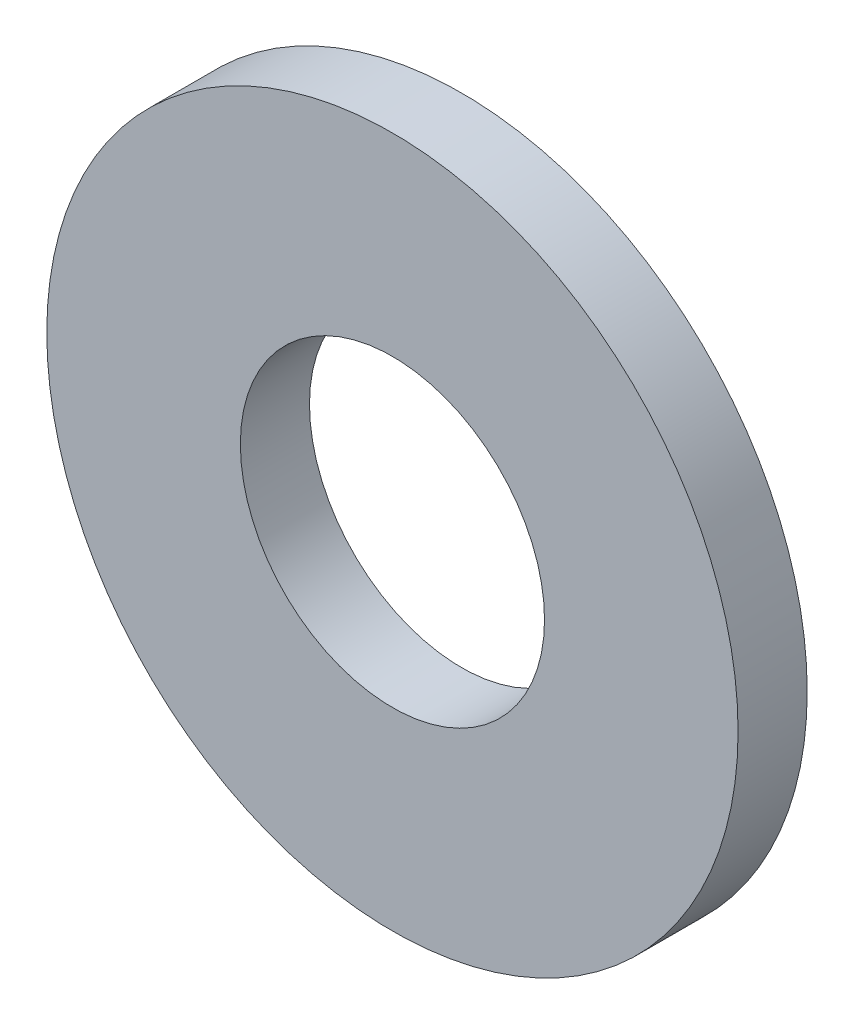
ISO-10303-21;
HEADER;
FILE_DESCRIPTION(('STEP AP214'),'2;1');
FILE_NAME('part.step','',(''),(''),'','','');
FILE_SCHEMA(('AUTOMOTIVE_DESIGN { 1 0 10303 214 1 1 1 1 }'));
ENDSEC;
DATA;
#1=APPLICATION_CONTEXT('core data for automotive mechanical design processes');
#2=APPLICATION_PROTOCOL_DEFINITION('international standard','automotive_design',2000,#1);
#3=PRODUCT_CONTEXT('',#1,'mechanical');
#4=PRODUCT('Part','Part','',(#3));
#5=PRODUCT_RELATED_PRODUCT_CATEGORY('part','',(#4));
#6=PRODUCT_DEFINITION_FORMATION('','',#4);
#7=PRODUCT_DEFINITION_CONTEXT('part definition',#1,'design');
#8=PRODUCT_DEFINITION('design','',#6,#7);
#9=PRODUCT_DEFINITION_SHAPE('','',#8);
#10=(LENGTH_UNIT() NAMED_UNIT(*) SI_UNIT(.MILLI.,.METRE.));
#11=(NAMED_UNIT(*) PLANE_ANGLE_UNIT() SI_UNIT($,.RADIAN.));
#12=(NAMED_UNIT(*) SI_UNIT($,.STERADIAN.) SOLID_ANGLE_UNIT());
#13=UNCERTAINTY_MEASURE_WITH_UNIT(LENGTH_MEASURE(1.E-05),#10,'distance_accuracy_value','');
#14=(GEOMETRIC_REPRESENTATION_CONTEXT(3) GLOBAL_UNCERTAINTY_ASSIGNED_CONTEXT((#13)) GLOBAL_UNIT_ASSIGNED_CONTEXT((#10,
#11,#12)) REPRESENTATION_CONTEXT('',''));
#15=CARTESIAN_POINT('',(0.,0.,0.));
#16=DIRECTION('',(0.,0.,1.));
#17=DIRECTION('',(1.,0.,0.));
#18=AXIS2_PLACEMENT_3D('',#15,#16,#17);
#19=CARTESIAN_POINT('',(0.,0.,-23.));
#20=DIRECTION('',(0.,0.,1.));
#21=DIRECTION('',(1.,0.,0.));
#22=AXIS2_PLACEMENT_3D('',#19,#20,#21);
#23=CYLINDRICAL_SURFACE('',#22,5.);
#24=CARTESIAN_POINT('',(0.,0.,-23.));
#25=DIRECTION('',(0.,0.,-1.));
#26=DIRECTION('',(-1.,0.,0.));
#27=AXIS2_PLACEMENT_3D('',#24,#25,#26);
#28=CIRCLE('',#27,5.);
#29=CARTESIAN_POINT('',(-5.,0.,-23.));
#30=VERTEX_POINT('',#29);
#31=EDGE_CURVE('E39',#30,#30,#28,.T.);
#32=ORIENTED_EDGE('',*,*,#31,.F.);
#33=EDGE_LOOP('',(#32));
#34=FACE_BOUND('',#33,.T.);
#35=CARTESIAN_POINT('',(0.,0.,-22.));
#36=DIRECTION('',(0.,0.,-1.));
#37=DIRECTION('',(-1.,0.,0.));
#38=AXIS2_PLACEMENT_3D('',#35,#36,#37);
#39=CIRCLE('',#38,5.);
#40=CARTESIAN_POINT('',(-5.,0.,-22.));
#41=VERTEX_POINT('',#40);
#42=EDGE_CURVE('E45',#41,#41,#39,.T.);
#43=ORIENTED_EDGE('',*,*,#42,.T.);
#44=EDGE_LOOP('',(#43));
#45=FACE_BOUND('',#44,.T.);
#46=ADVANCED_FACE('F32',(#34,#45),#23,.T.);
#47=CARTESIAN_POINT('',(0.,0.,-23.));
#48=DIRECTION('',(0.,0.,1.));
#49=DIRECTION('',(1.,0.,0.));
#50=AXIS2_PLACEMENT_3D('',#47,#48,#49);
#51=CYLINDRICAL_SURFACE('',#50,2.2);
#52=CARTESIAN_POINT('',(0.,0.,-23.));
#53=DIRECTION('',(0.,0.,-1.));
#54=DIRECTION('',(-1.,0.,0.));
#55=AXIS2_PLACEMENT_3D('',#52,#53,#54);
#56=CIRCLE('',#55,2.2);
#57=CARTESIAN_POINT('',(-2.2,0.,-23.));
#58=VERTEX_POINT('',#57);
#59=EDGE_CURVE('E10',#58,#58,#56,.F.);
#60=ORIENTED_EDGE('',*,*,#59,.F.);
#61=EDGE_LOOP('',(#60));
#62=FACE_BOUND('',#61,.T.);
#63=CARTESIAN_POINT('',(0.,0.,-22.));
#64=DIRECTION('',(0.,0.,-1.));
#65=DIRECTION('',(-1.,0.,0.));
#66=AXIS2_PLACEMENT_3D('',#63,#64,#65);
#67=CIRCLE('',#66,2.2);
#68=CARTESIAN_POINT('',(-2.2,0.,-22.));
#69=VERTEX_POINT('',#68);
#70=EDGE_CURVE('E35',#69,#69,#67,.F.);
#71=ORIENTED_EDGE('',*,*,#70,.T.);
#72=EDGE_LOOP('',(#71));
#73=FACE_BOUND('',#72,.T.);
#74=ADVANCED_FACE('F52',(#62,#73),#51,.F.);
#75=CARTESIAN_POINT('',(0.,0.,-23.));
#76=DIRECTION('',(0.,0.,-1.));
#77=DIRECTION('',(-1.,0.,0.));
#78=AXIS2_PLACEMENT_3D('',#75,#76,#77);
#79=PLANE('',#78);
#80=ORIENTED_EDGE('',*,*,#31,.T.);
#81=EDGE_LOOP('',(#80));
#82=FACE_BOUND('',#81,.T.);
#83=ORIENTED_EDGE('',*,*,#59,.T.);
#84=EDGE_LOOP('',(#83));
#85=FACE_BOUND('',#84,.T.);
#86=ADVANCED_FACE('F56',(#82,#85),#79,.T.);
#87=CARTESIAN_POINT('',(0.,0.,-22.));
#88=DIRECTION('',(0.,0.,-1.));
#89=DIRECTION('',(-1.,0.,0.));
#90=AXIS2_PLACEMENT_3D('',#87,#88,#89);
#91=PLANE('',#90);
#92=ORIENTED_EDGE('',*,*,#42,.F.);
#93=EDGE_LOOP('',(#92));
#94=FACE_BOUND('',#93,.T.);
#95=ORIENTED_EDGE('',*,*,#70,.F.);
#96=EDGE_LOOP('',(#95));
#97=FACE_BOUND('',#96,.T.);
#98=ADVANCED_FACE('F54',(#94,#97),#91,.F.);
#99=CLOSED_SHELL('',(#46,#74,#86,#98));
#100=MANIFOLD_SOLID_BREP('B2',#99);
#101=ADVANCED_BREP_SHAPE_REPRESENTATION('',(#18,#100),#14);
#102=SHAPE_DEFINITION_REPRESENTATION(#9,#101);
ENDSEC;
END-ISO-10303-21;
